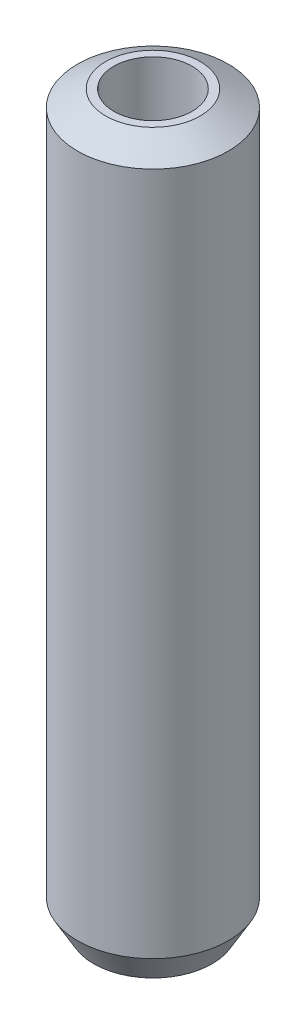
ISO-10303-21;
HEADER;
FILE_DESCRIPTION(('STEP AP214'),'2;1');
FILE_NAME('part.step','',(''),(''),'','','');
FILE_SCHEMA(('AUTOMOTIVE_DESIGN { 1 0 10303 214 1 1 1 1 }'));
ENDSEC;
DATA;
#1=APPLICATION_CONTEXT('core data for automotive mechanical design processes');
#2=APPLICATION_PROTOCOL_DEFINITION('international standard','automotive_design',2000,#1);
#3=PRODUCT_CONTEXT('',#1,'mechanical');
#4=PRODUCT('Part','Part','',(#3));
#5=PRODUCT_RELATED_PRODUCT_CATEGORY('part','',(#4));
#6=PRODUCT_DEFINITION_FORMATION('','',#4);
#7=PRODUCT_DEFINITION_CONTEXT('part definition',#1,'design');
#8=PRODUCT_DEFINITION('design','',#6,#7);
#9=PRODUCT_DEFINITION_SHAPE('','',#8);
#10=(LENGTH_UNIT() NAMED_UNIT(*) SI_UNIT(.MILLI.,.METRE.));
#11=(NAMED_UNIT(*) PLANE_ANGLE_UNIT() SI_UNIT($,.RADIAN.));
#12=(NAMED_UNIT(*) SI_UNIT($,.STERADIAN.) SOLID_ANGLE_UNIT());
#13=UNCERTAINTY_MEASURE_WITH_UNIT(LENGTH_MEASURE(1.E-05),#10,'distance_accuracy_value','');
#14=(GEOMETRIC_REPRESENTATION_CONTEXT(3) GLOBAL_UNCERTAINTY_ASSIGNED_CONTEXT((#13)) GLOBAL_UNIT_ASSIGNED_CONTEXT((#10,
#11,#12)) REPRESENTATION_CONTEXT('',''));
#15=CARTESIAN_POINT('',(0.,0.,0.));
#16=DIRECTION('',(0.,0.,1.));
#17=DIRECTION('',(1.,0.,0.));
#18=AXIS2_PLACEMENT_3D('',#15,#16,#17);
#19=CARTESIAN_POINT('',(0.,168.990619340528,0.));
#20=DIRECTION('',(0.,-1.,0.));
#21=DIRECTION('',(0.,0.,-1.));
#22=AXIS2_PLACEMENT_3D('',#19,#20,#21);
#23=CYLINDRICAL_SURFACE('',#22,17.5);
#24=CARTESIAN_POINT('',(0.,165.213354329047,0.));
#25=DIRECTION('',(0.,1.,0.));
#26=DIRECTION('',(0.,0.,1.));
#27=AXIS2_PLACEMENT_3D('',#24,#25,#26);
#28=CIRCLE('',#27,17.5);
#29=CARTESIAN_POINT('',(0.,165.213354329047,17.5));
#30=VERTEX_POINT('',#29);
#31=EDGE_CURVE('E50',#30,#30,#28,.F.);
#32=ORIENTED_EDGE('',*,*,#31,.T.);
#33=EDGE_LOOP('',(#32));
#34=FACE_BOUND('',#33,.T.);
#35=CARTESIAN_POINT('',(0.,6.54241491353694,0.));
#36=DIRECTION('',(0.,1.,0.));
#37=DIRECTION('',(0.,0.,1.));
#38=AXIS2_PLACEMENT_3D('',#35,#36,#37);
#39=CIRCLE('',#38,17.5);
#40=CARTESIAN_POINT('',(0.,6.54241491353694,17.5));
#41=VERTEX_POINT('',#40);
#42=EDGE_CURVE('E51',#41,#41,#39,.T.);
#43=ORIENTED_EDGE('',*,*,#42,.T.);
#44=EDGE_LOOP('',(#43));
#45=FACE_BOUND('',#44,.T.);
#46=ADVANCED_FACE('F39',(#34,#45),#23,.T.);
#47=CARTESIAN_POINT('',(0.,168.990619340528,0.));
#48=DIRECTION('',(0.,1.,0.));
#49=DIRECTION('',(0.,0.,1.));
#50=AXIS2_PLACEMENT_3D('',#47,#48,#49);
#51=PLANE('',#50);
#52=CARTESIAN_POINT('',(0.,168.990619340528,0.));
#53=DIRECTION('',(0.,1.,0.));
#54=DIRECTION('',(0.,0.,1.));
#55=AXIS2_PLACEMENT_3D('',#52,#53,#54);
#56=CIRCLE('',#55,10.9575850864631);
#57=CARTESIAN_POINT('',(0.,168.990619340528,10.9575850864631));
#58=VERTEX_POINT('',#57);
#59=EDGE_CURVE('E54',#58,#58,#56,.T.);
#60=ORIENTED_EDGE('',*,*,#59,.T.);
#61=EDGE_LOOP('',(#60));
#62=FACE_BOUND('',#61,.T.);
#63=CARTESIAN_POINT('',(0.,168.990619340528,0.));
#64=DIRECTION('',(0.,1.,0.));
#65=DIRECTION('',(0.,0.,1.));
#66=AXIS2_PLACEMENT_3D('',#63,#64,#65);
#67=CIRCLE('',#66,9.08196572303039);
#68=CARTESIAN_POINT('',(0.,168.990619340528,9.08196572303039));
#69=VERTEX_POINT('',#68);
#70=EDGE_CURVE('E58',#69,#69,#67,.T.);
#71=ORIENTED_EDGE('',*,*,#70,.F.);
#72=EDGE_LOOP('',(#71));
#73=FACE_BOUND('',#72,.T.);
#74=ADVANCED_FACE('F69',(#62,#73),#51,.T.);
#75=CARTESIAN_POINT('',(0.,0.,0.));
#76=DIRECTION('',(0.,1.,0.));
#77=DIRECTION('',(0.,0.,1.));
#78=AXIS2_PLACEMENT_3D('',#75,#76,#77);
#79=PLANE('',#78);
#80=CARTESIAN_POINT('',(0.,0.,0.));
#81=DIRECTION('',(0.,1.,0.));
#82=DIRECTION('',(0.,0.,1.));
#83=AXIS2_PLACEMENT_3D('',#80,#81,#82);
#84=CIRCLE('',#83,13.7227349885192);
#85=CARTESIAN_POINT('',(0.,0.,13.7227349885192));
#86=VERTEX_POINT('',#85);
#87=EDGE_CURVE('E10',#86,#86,#84,.F.);
#88=ORIENTED_EDGE('',*,*,#87,.T.);
#89=EDGE_LOOP('',(#88));
#90=FACE_BOUND('',#89,.T.);
#91=CARTESIAN_POINT('',(0.,0.,0.));
#92=DIRECTION('',(0.,1.,0.));
#93=DIRECTION('',(0.,0.,1.));
#94=AXIS2_PLACEMENT_3D('',#91,#92,#93);
#95=CIRCLE('',#94,9.08196572303039);
#96=CARTESIAN_POINT('',(0.,0.,9.08196572303039));
#97=VERTEX_POINT('',#96);
#98=EDGE_CURVE('E63',#97,#97,#95,.T.);
#99=ORIENTED_EDGE('',*,*,#98,.T.);
#100=EDGE_LOOP('',(#99));
#101=FACE_BOUND('',#100,.T.);
#102=ADVANCED_FACE('F75',(#90,#101),#79,.F.);
#103=CARTESIAN_POINT('',(0.,168.990619340528,0.));
#104=DIRECTION('',(0.,-1.,0.));
#105=DIRECTION('',(0.,0.,-1.));
#106=AXIS2_PLACEMENT_3D('',#103,#104,#105);
#107=CYLINDRICAL_SURFACE('',#106,9.08196572303039);
#108=ORIENTED_EDGE('',*,*,#70,.T.);
#109=EDGE_LOOP('',(#108));
#110=FACE_BOUND('',#109,.T.);
#111=ORIENTED_EDGE('',*,*,#98,.F.);
#112=EDGE_LOOP('',(#111));
#113=FACE_BOUND('',#112,.T.);
#114=ADVANCED_FACE('F70',(#110,#113),#107,.F.);
#115=CARTESIAN_POINT('',(0.,168.990619340528,0.));
#116=DIRECTION('',(0.,-1.,0.));
#117=DIRECTION('',(0.,0.,-1.));
#118=AXIS2_PLACEMENT_3D('',#115,#116,#117);
#119=CONICAL_SURFACE('',#118,10.9575850864631,1.04719755119659);
#120=ORIENTED_EDGE('',*,*,#31,.F.);
#121=EDGE_LOOP('',(#120));
#122=FACE_BOUND('',#121,.T.);
#123=ORIENTED_EDGE('',*,*,#59,.F.);
#124=EDGE_LOOP('',(#123));
#125=FACE_BOUND('',#124,.T.);
#126=ADVANCED_FACE('F81',(#122,#125),#119,.T.);
#127=CARTESIAN_POINT('',(0.,6.54241491353694,0.));
#128=DIRECTION('',(0.,1.,0.));
#129=DIRECTION('',(0.,0.,1.));
#130=AXIS2_PLACEMENT_3D('',#127,#128,#129);
#131=CONICAL_SURFACE('',#130,17.5,0.523598775598303);
#132=CARTESIAN_POINT('',(0.,0.,13.7227349885192));
#133=CARTESIAN_POINT('',(0.,0.0681501553493419,13.7620814990555));
#134=CARTESIAN_POINT('',(0.,0.136300310698685,13.8014280095917));
#135=CARTESIAN_POINT('',(0.,0.272600621397371,13.8801210306642));
#136=CARTESIAN_POINT('',(0.,0.340750776746715,13.9194675412005));
#137=CARTESIAN_POINT('',(0.,0.477051087445401,13.998160562273));
#138=CARTESIAN_POINT('',(0.,0.545201242794744,14.0375070728093));
#139=CARTESIAN_POINT('',(0.,0.68150155349343,14.1162000938818));
#140=CARTESIAN_POINT('',(0.,0.749651708842773,14.155546604418));
#141=CARTESIAN_POINT('',(0.,0.885952019541459,14.2342396254906));
#142=CARTESIAN_POINT('',(0.,0.954102174890802,14.2735861360268));
#143=CARTESIAN_POINT('',(0.,1.09040248558949,14.3522791570993));
#144=CARTESIAN_POINT('',(0.,1.15855264093883,14.3916256676356));
#145=CARTESIAN_POINT('',(0.,1.29485295163752,14.4703186887081));
#146=CARTESIAN_POINT('',(0.,1.36300310698686,14.5096651992444));
#147=CARTESIAN_POINT('',(0.,1.49930341768555,14.5883582203169));
#148=CARTESIAN_POINT('',(0.,1.56745357303489,14.6277047308531));
#149=CARTESIAN_POINT('',(0.,1.70375388373358,14.7063977519257));
#150=CARTESIAN_POINT('',(0.,1.77190403908292,14.7457442624619));
#151=CARTESIAN_POINT('',(0.,1.90820434978161,14.8244372835344));
#152=CARTESIAN_POINT('',(0.,1.97635450513095,14.8637837940707));
#153=CARTESIAN_POINT('',(0.,2.11265481582964,14.9424768151432));
#154=CARTESIAN_POINT('',(0.,2.18080497117898,14.9818233256795));
#155=CARTESIAN_POINT('',(0.,2.31710528187766,15.060516346752));
#156=CARTESIAN_POINT('',(0.,2.38525543722701,15.0998628572882));
#157=CARTESIAN_POINT('',(0.,2.52155574792569,15.1785558783608));
#158=CARTESIAN_POINT('',(0.,2.58970590327504,15.217902388897));
#159=CARTESIAN_POINT('',(0.,2.72600621397372,15.2965954099695));
#160=CARTESIAN_POINT('',(0.,2.79415636932307,15.3359419205058));
#161=CARTESIAN_POINT('',(0.,2.93045668002175,15.4146349415783));
#162=CARTESIAN_POINT('',(0.,2.9986068353711,15.4539814521146));
#163=CARTESIAN_POINT('',(0.,3.13490714606978,15.5326744731871));
#164=CARTESIAN_POINT('',(0.,3.20305730141912,15.5720209837233));
#165=CARTESIAN_POINT('',(0.,3.33935761211781,15.6507140047959));
#166=CARTESIAN_POINT('',(0.,3.40750776746715,15.6900605153321));
#167=CARTESIAN_POINT('',(0.,3.54380807816584,15.7687535364046));
#168=CARTESIAN_POINT('',(0.,3.61195823351518,15.8081000469409));
#169=CARTESIAN_POINT('',(0.,3.74825854421387,15.8867930680134));
#170=CARTESIAN_POINT('',(0.,3.81640869956321,15.9261395785497));
#171=CARTESIAN_POINT('',(0.,3.9527090102619,16.0048325996222));
#172=CARTESIAN_POINT('',(0.,4.02085916561124,16.0441791101584));
#173=CARTESIAN_POINT('',(0.,4.15715947630993,16.122872131231));
#174=CARTESIAN_POINT('',(0.,4.22530963165927,16.1622186417672));
#175=CARTESIAN_POINT('',(0.,4.36160994235796,16.2409116628397));
#176=CARTESIAN_POINT('',(0.,4.4297600977073,16.280258173376));
#177=CARTESIAN_POINT('',(0.,4.56606040840599,16.3589511944485));
#178=CARTESIAN_POINT('',(0.,4.63421056375533,16.3982977049848));
#179=CARTESIAN_POINT('',(0.,4.77051087445402,16.4769907260573));
#180=CARTESIAN_POINT('',(0.,4.83866102980336,16.5163372365935));
#181=CARTESIAN_POINT('',(0.,4.97496134050205,16.5950302576661));
#182=CARTESIAN_POINT('',(0.,5.04311149585139,16.6343767682023));
#183=CARTESIAN_POINT('',(0.,5.17941180655007,16.7130697892748));
#184=CARTESIAN_POINT('',(0.,5.24756196189942,16.7524162998111));
#185=CARTESIAN_POINT('',(0.,5.3838622725981,16.8311093208836));
#186=CARTESIAN_POINT('',(0.,5.45201242794745,16.8704558314199));
#187=CARTESIAN_POINT('',(0.,5.58831273864613,16.9491488524924));
#188=CARTESIAN_POINT('',(0.,5.65646289399548,16.9884953630286));
#189=CARTESIAN_POINT('',(0.,5.79276320469416,17.0671883841012));
#190=CARTESIAN_POINT('',(0.,5.86091336004351,17.1065348946374));
#191=CARTESIAN_POINT('',(0.,5.99721367074219,17.1852279157099));
#192=CARTESIAN_POINT('',(0.,6.06536382609154,17.2245744262462));
#193=CARTESIAN_POINT('',(0.,6.20166413679022,17.3032674473187));
#194=CARTESIAN_POINT('',(0.,6.26981429213956,17.342613957855));
#195=CARTESIAN_POINT('',(0.,6.40611460283825,17.4213069789275));
#196=CARTESIAN_POINT('',(0.,6.47426475818759,17.4606534894637));
#197=CARTESIAN_POINT('',(0.,6.54241491353694,17.5));
#198=B_SPLINE_CURVE_WITH_KNOTS('',3,(#132,#133,#134,#135,#136,#137,#138,#139,#140,#141,#142,
#143,#144,#145,#146,#147,#148,#149,#150,#151,#152,#153,#154,#155,#156,#157,#158,#159,#160,#161,
#162,#163,#164,#165,#166,#167,#168,#169,#170,#171,#172,#173,#174,#175,#176,#177,#178,#179,#180,
#181,#182,#183,#184,#185,#186,#187,#188,#189,#190,#191,#192,#193,#194,#195,#196,#197),
.UNSPECIFIED.,.F.,.F.,(4,2,2,2,2,2,2,2,2,2,2,2,2,2,2,2,2,2,2,2,2,2,2,2,2,2,2,2,2,2,2,2,4),(0.,
0.236079063217549,0.472158126435098,0.708237189652647,0.944316252870195,1.18039531608774,
1.41647437930529,1.65255344252284,1.88863250574039,2.12471156895794,2.36079063217549,
2.59686969539304,2.83294875861059,3.06902782182814,3.30510688504568,3.54118594826323,
3.77726501148078,4.01334407469833,4.24942313791588,4.48550220113343,4.72158126435098,
4.95766032756852,5.19373939078607,5.42981845400362,5.66589751722117,5.90197658043872,
6.13805564365627,6.37413470687382,6.61021377009137,6.84629283330892,7.08237189652647,
7.31845095974402,7.55453002296156),.UNSPECIFIED.);
#199=EDGE_CURVE('BSEAM45',#86,#41,#198,.T.);
#200=ORIENTED_EDGE('',*,*,#87,.F.);
#201=ORIENTED_EDGE('',*,*,#42,.F.);
#202=ORIENTED_EDGE('',*,*,#199,.T.);
#203=ORIENTED_EDGE('',*,*,#199,.F.);
#204=EDGE_LOOP('',(#200,#202,#201,#203));
#205=FACE_BOUND('',#204,.T.);
#206=ADVANCED_FACE('F45',(#205),#131,.T.);
#207=CLOSED_SHELL('',(#46,#74,#102,#114,#126,#206));
#208=MANIFOLD_SOLID_BREP('B2',#207);
#209=ADVANCED_BREP_SHAPE_REPRESENTATION('',(#18,#208),#14);
#210=SHAPE_DEFINITION_REPRESENTATION(#9,#209);
ENDSEC;
END-ISO-10303-21;
